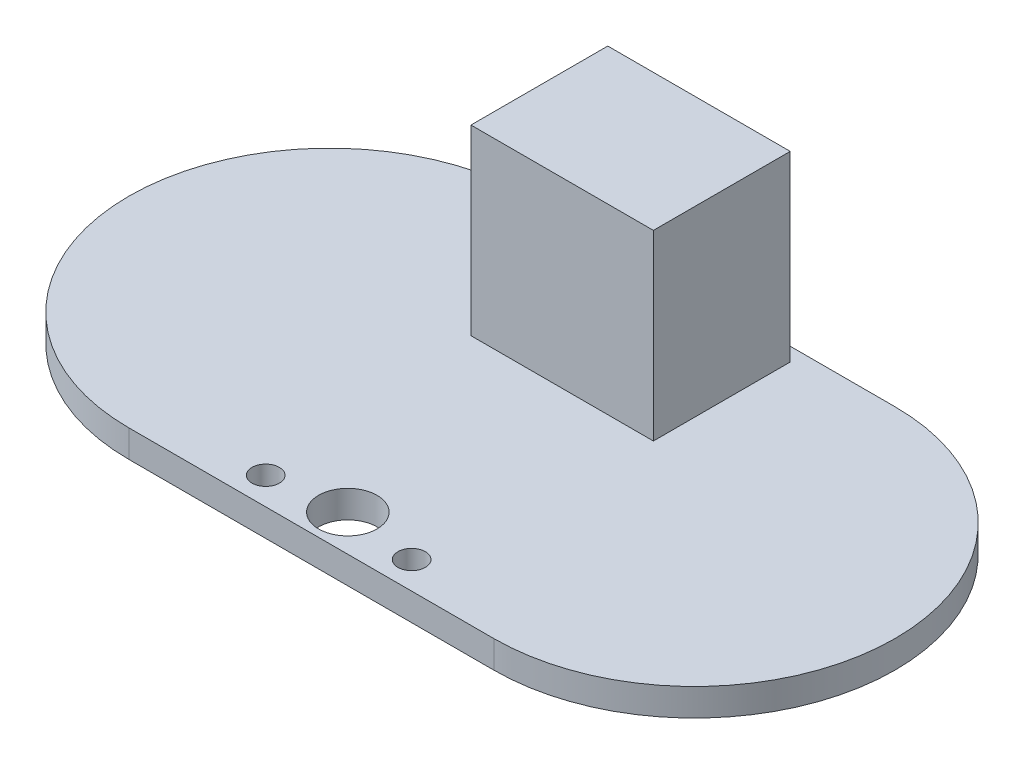
ISO-10303-21;
HEADER;
FILE_DESCRIPTION(('STEP AP214'),'2;1');
FILE_NAME('part.step','',(''),(''),'','','');
FILE_SCHEMA(('AUTOMOTIVE_DESIGN { 1 0 10303 214 1 1 1 1 }'));
ENDSEC;
DATA;
#1=APPLICATION_CONTEXT('core data for automotive mechanical design processes');
#2=APPLICATION_PROTOCOL_DEFINITION('international standard','automotive_design',2000,#1);
#3=PRODUCT_CONTEXT('',#1,'mechanical');
#4=PRODUCT('Part','Part','',(#3));
#5=PRODUCT_RELATED_PRODUCT_CATEGORY('part','',(#4));
#6=PRODUCT_DEFINITION_FORMATION('','',#4);
#7=PRODUCT_DEFINITION_CONTEXT('part definition',#1,'design');
#8=PRODUCT_DEFINITION('design','',#6,#7);
#9=PRODUCT_DEFINITION_SHAPE('','',#8);
#10=(LENGTH_UNIT() NAMED_UNIT(*) SI_UNIT(.MILLI.,.METRE.));
#11=(NAMED_UNIT(*) PLANE_ANGLE_UNIT() SI_UNIT($,.RADIAN.));
#12=(NAMED_UNIT(*) SI_UNIT($,.STERADIAN.) SOLID_ANGLE_UNIT());
#13=UNCERTAINTY_MEASURE_WITH_UNIT(LENGTH_MEASURE(1.E-05),#10,'distance_accuracy_value','');
#14=(GEOMETRIC_REPRESENTATION_CONTEXT(3) GLOBAL_UNCERTAINTY_ASSIGNED_CONTEXT((#13)) GLOBAL_UNIT_ASSIGNED_CONTEXT((#10,
#11,#12)) REPRESENTATION_CONTEXT('',''));
#15=CARTESIAN_POINT('',(0.,0.,0.));
#16=DIRECTION('',(0.,0.,1.));
#17=DIRECTION('',(1.,0.,0.));
#18=AXIS2_PLACEMENT_3D('',#15,#16,#17);
#19=CARTESIAN_POINT('',(0.,1.5,0.));
#20=DIRECTION('',(0.,1.,0.));
#21=DIRECTION('',(0.,0.,1.));
#22=AXIS2_PLACEMENT_3D('',#19,#20,#21);
#23=PLANE('',#22);
#24=CARTESIAN_POINT('',(4.,1.5,9.5));
#25=DIRECTION('',(0.,1.,0.));
#26=DIRECTION('',(0.,0.,1.));
#27=AXIS2_PLACEMENT_3D('',#24,#25,#26);
#28=CIRCLE('',#27,0.750000000000001);
#29=CARTESIAN_POINT('',(4.,1.5,10.25));
#30=VERTEX_POINT('',#29);
#31=EDGE_CURVE('E346',#30,#30,#28,.T.);
#32=ORIENTED_EDGE('',*,*,#31,.F.);
#33=EDGE_LOOP('',(#32));
#34=FACE_BOUND('',#33,.T.);
#35=CARTESIAN_POINT('',(-4.,1.5,9.5));
#36=DIRECTION('',(0.,1.,0.));
#37=DIRECTION('',(0.,0.,1.));
#38=AXIS2_PLACEMENT_3D('',#35,#36,#37);
#39=CIRCLE('',#38,0.75);
#40=CARTESIAN_POINT('',(-4.,1.5,10.25));
#41=VERTEX_POINT('',#40);
#42=EDGE_CURVE('E350',#41,#41,#39,.T.);
#43=ORIENTED_EDGE('',*,*,#42,.F.);
#44=EDGE_LOOP('',(#43));
#45=FACE_BOUND('',#44,.T.);
#46=CARTESIAN_POINT('',(0.,1.5,9.));
#47=DIRECTION('',(0.,1.,0.));
#48=DIRECTION('',(0.,0.,1.));
#49=AXIS2_PLACEMENT_3D('',#46,#47,#48);
#50=CIRCLE('',#49,1.6);
#51=CARTESIAN_POINT('',(0.,1.5,10.6));
#52=VERTEX_POINT('',#51);
#53=EDGE_CURVE('E358',#52,#52,#50,.T.);
#54=ORIENTED_EDGE('',*,*,#53,.F.);
#55=EDGE_LOOP('',(#54));
#56=FACE_BOUND('',#55,.T.);
#57=DIRECTION('',(-1.,0.,0.));
#58=VECTOR('',#57,1.);
#59=CARTESIAN_POINT('',(0.,1.5,11.));
#60=LINE('',#59,#58);
#61=CARTESIAN_POINT('',(10.,1.5,11.));
#62=VERTEX_POINT('',#61);
#63=CARTESIAN_POINT('',(-10.,1.5,11.));
#64=VERTEX_POINT('',#63);
#65=EDGE_CURVE('E138',#62,#64,#60,.T.);
#66=ORIENTED_EDGE('',*,*,#65,.F.);
#67=CARTESIAN_POINT('',(10.,1.5,0.));
#68=DIRECTION('',(0.,1.,0.));
#69=DIRECTION('',(0.,0.,1.));
#70=AXIS2_PLACEMENT_3D('',#67,#68,#69);
#71=CIRCLE('',#70,11.);
#72=CARTESIAN_POINT('',(10.,1.5,-11.));
#73=VERTEX_POINT('',#72);
#74=EDGE_CURVE('E140',#62,#73,#71,.T.);
#75=ORIENTED_EDGE('',*,*,#74,.T.);
#76=DIRECTION('',(-1.,0.,0.));
#77=VECTOR('',#76,1.);
#78=CARTESIAN_POINT('',(0.,1.5,-11.));
#79=LINE('',#78,#77);
#80=CARTESIAN_POINT('',(-10.,1.5,-11.));
#81=VERTEX_POINT('',#80);
#82=EDGE_CURVE('E143',#73,#81,#79,.T.);
#83=ORIENTED_EDGE('',*,*,#82,.T.);
#84=CARTESIAN_POINT('',(-10.,1.5,0.));
#85=DIRECTION('',(0.,1.,0.));
#86=DIRECTION('',(0.,0.,1.));
#87=AXIS2_PLACEMENT_3D('',#84,#85,#86);
#88=CIRCLE('',#87,11.);
#89=EDGE_CURVE('E145',#64,#81,#88,.F.);
#90=ORIENTED_EDGE('',*,*,#89,.F.);
#91=EDGE_LOOP('',(#66,#75,#83,#90));
#92=FACE_BOUND('',#91,.T.);
#93=DIRECTION('',(-1.,0.,0.));
#94=VECTOR('',#93,1.);
#95=CARTESIAN_POINT('',(-5.,1.5,-10.25));
#96=LINE('',#95,#94);
#97=CARTESIAN_POINT('',(5.,1.5,-10.25));
#98=VERTEX_POINT('',#97);
#99=CARTESIAN_POINT('',(-5.,1.5,-10.25));
#100=VERTEX_POINT('',#99);
#101=EDGE_CURVE('E365',#98,#100,#96,.T.);
#102=ORIENTED_EDGE('',*,*,#101,.F.);
#103=DIRECTION('',(0.,0.,-1.));
#104=VECTOR('',#103,1.);
#105=CARTESIAN_POINT('',(5.,1.5,-10.25));
#106=LINE('',#105,#104);
#107=CARTESIAN_POINT('',(5.,1.5,-2.75));
#108=VERTEX_POINT('',#107);
#109=EDGE_CURVE('E129',#108,#98,#106,.T.);
#110=ORIENTED_EDGE('',*,*,#109,.F.);
#111=DIRECTION('',(1.,0.,0.));
#112=VECTOR('',#111,1.);
#113=CARTESIAN_POINT('',(-5.,1.5,-2.75));
#114=LINE('',#113,#112);
#115=CARTESIAN_POINT('',(-5.,1.5,-2.75));
#116=VERTEX_POINT('',#115);
#117=EDGE_CURVE('E125',#116,#108,#114,.T.);
#118=ORIENTED_EDGE('',*,*,#117,.F.);
#119=DIRECTION('',(0.,0.,1.));
#120=VECTOR('',#119,1.);
#121=CARTESIAN_POINT('',(-5.,1.5,-10.25));
#122=LINE('',#121,#120);
#123=EDGE_CURVE('E367',#100,#116,#122,.T.);
#124=ORIENTED_EDGE('',*,*,#123,.F.);
#125=EDGE_LOOP('',(#102,#110,#118,#124));
#126=FACE_BOUND('',#125,.T.);
#127=ADVANCED_FACE('F37',(#34,#45,#56,#92,#126),#23,.T.);
#128=CARTESIAN_POINT('',(0.,1.5,11.));
#129=DIRECTION('',(0.,0.,1.));
#130=DIRECTION('',(1.,0.,0.));
#131=AXIS2_PLACEMENT_3D('',#128,#129,#130);
#132=PLANE('',#131);
#133=DIRECTION('',(-1.,0.,0.));
#134=VECTOR('',#133,1.);
#135=CARTESIAN_POINT('',(0.,0.,11.));
#136=LINE('',#135,#134);
#137=CARTESIAN_POINT('',(10.,0.,11.));
#138=VERTEX_POINT('',#137);
#139=CARTESIAN_POINT('',(-10.,0.,11.));
#140=VERTEX_POINT('',#139);
#141=EDGE_CURVE('E131',#138,#140,#136,.T.);
#142=ORIENTED_EDGE('',*,*,#141,.F.);
#143=DIRECTION('',(0.,-1.,0.));
#144=VECTOR('',#143,1.);
#145=CARTESIAN_POINT('',(10.,1.5,11.));
#146=LINE('',#145,#144);
#147=EDGE_CURVE('E11',#62,#138,#146,.T.);
#148=ORIENTED_EDGE('',*,*,#147,.F.);
#149=ORIENTED_EDGE('',*,*,#65,.T.);
#150=DIRECTION('',(0.,-1.,0.));
#151=VECTOR('',#150,1.);
#152=CARTESIAN_POINT('',(-10.,1.5,11.));
#153=LINE('',#152,#151);
#154=EDGE_CURVE('E61',#64,#140,#153,.T.);
#155=ORIENTED_EDGE('',*,*,#154,.T.);
#156=EDGE_LOOP('',(#142,#148,#149,#155));
#157=FACE_BOUND('',#156,.T.);
#158=ADVANCED_FACE('F39',(#157),#132,.T.);
#159=CARTESIAN_POINT('',(10.,1.5,0.));
#160=DIRECTION('',(0.,-1.,0.));
#161=DIRECTION('',(0.,0.,-1.));
#162=AXIS2_PLACEMENT_3D('',#159,#160,#161);
#163=CYLINDRICAL_SURFACE('',#162,11.);
#164=CARTESIAN_POINT('',(10.,0.,0.));
#165=DIRECTION('',(0.,1.,0.));
#166=DIRECTION('',(0.,0.,1.));
#167=AXIS2_PLACEMENT_3D('',#164,#165,#166);
#168=CIRCLE('',#167,11.);
#169=CARTESIAN_POINT('',(10.,0.,-11.));
#170=VERTEX_POINT('',#169);
#171=EDGE_CURVE('E133',#138,#170,#168,.T.);
#172=ORIENTED_EDGE('',*,*,#171,.T.);
#173=DIRECTION('',(0.,-1.,0.));
#174=VECTOR('',#173,1.);
#175=CARTESIAN_POINT('',(10.,1.5,-11.));
#176=LINE('',#175,#174);
#177=EDGE_CURVE('E45',#73,#170,#176,.T.);
#178=ORIENTED_EDGE('',*,*,#177,.F.);
#179=ORIENTED_EDGE('',*,*,#74,.F.);
#180=ORIENTED_EDGE('',*,*,#147,.T.);
#181=EDGE_LOOP('',(#172,#178,#179,#180));
#182=FACE_BOUND('',#181,.T.);
#183=ADVANCED_FACE('F171',(#182),#163,.T.);
#184=CARTESIAN_POINT('',(0.,1.5,-11.));
#185=DIRECTION('',(0.,0.,1.));
#186=DIRECTION('',(1.,0.,0.));
#187=AXIS2_PLACEMENT_3D('',#184,#185,#186);
#188=PLANE('',#187);
#189=DIRECTION('',(-1.,0.,0.));
#190=VECTOR('',#189,1.);
#191=CARTESIAN_POINT('',(0.,0.,-11.));
#192=LINE('',#191,#190);
#193=CARTESIAN_POINT('',(-10.,0.,-11.));
#194=VERTEX_POINT('',#193);
#195=EDGE_CURVE('E148',#170,#194,#192,.T.);
#196=ORIENTED_EDGE('',*,*,#195,.T.);
#197=DIRECTION('',(0.,-1.,0.));
#198=VECTOR('',#197,1.);
#199=CARTESIAN_POINT('',(-10.,1.5,-11.));
#200=LINE('',#199,#198);
#201=EDGE_CURVE('E154',#81,#194,#200,.T.);
#202=ORIENTED_EDGE('',*,*,#201,.F.);
#203=ORIENTED_EDGE('',*,*,#82,.F.);
#204=ORIENTED_EDGE('',*,*,#177,.T.);
#205=EDGE_LOOP('',(#196,#202,#203,#204));
#206=FACE_BOUND('',#205,.T.);
#207=ADVANCED_FACE('F160',(#206),#188,.F.);
#208=CARTESIAN_POINT('',(-10.,1.5,0.));
#209=DIRECTION('',(0.,-1.,0.));
#210=DIRECTION('',(0.,0.,-1.));
#211=AXIS2_PLACEMENT_3D('',#208,#209,#210);
#212=CYLINDRICAL_SURFACE('',#211,11.);
#213=CARTESIAN_POINT('',(-10.,0.,0.));
#214=DIRECTION('',(0.,1.,0.));
#215=DIRECTION('',(0.,0.,1.));
#216=AXIS2_PLACEMENT_3D('',#213,#214,#215);
#217=CIRCLE('',#216,11.);
#218=EDGE_CURVE('E141',#140,#194,#217,.F.);
#219=ORIENTED_EDGE('',*,*,#218,.F.);
#220=ORIENTED_EDGE('',*,*,#154,.F.);
#221=ORIENTED_EDGE('',*,*,#89,.T.);
#222=ORIENTED_EDGE('',*,*,#201,.T.);
#223=EDGE_LOOP('',(#219,#220,#221,#222));
#224=FACE_BOUND('',#223,.T.);
#225=ADVANCED_FACE('F166',(#224),#212,.T.);
#226=CARTESIAN_POINT('',(0.,0.,0.));
#227=DIRECTION('',(0.,1.,0.));
#228=DIRECTION('',(0.,0.,1.));
#229=AXIS2_PLACEMENT_3D('',#226,#227,#228);
#230=PLANE('',#229);
#231=CARTESIAN_POINT('',(4.,0.,9.5));
#232=DIRECTION('',(0.,1.,0.));
#233=DIRECTION('',(0.,0.,1.));
#234=AXIS2_PLACEMENT_3D('',#231,#232,#233);
#235=CIRCLE('',#234,0.750000000000001);
#236=CARTESIAN_POINT('',(4.,0.,10.25));
#237=VERTEX_POINT('',#236);
#238=EDGE_CURVE('E344',#237,#237,#235,.T.);
#239=ORIENTED_EDGE('',*,*,#238,.T.);
#240=EDGE_LOOP('',(#239));
#241=FACE_BOUND('',#240,.T.);
#242=CARTESIAN_POINT('',(-4.,0.,9.5));
#243=DIRECTION('',(0.,1.,0.));
#244=DIRECTION('',(0.,0.,1.));
#245=AXIS2_PLACEMENT_3D('',#242,#243,#244);
#246=CIRCLE('',#245,0.75);
#247=CARTESIAN_POINT('',(-4.,0.,10.25));
#248=VERTEX_POINT('',#247);
#249=EDGE_CURVE('E347',#248,#248,#246,.T.);
#250=ORIENTED_EDGE('',*,*,#249,.T.);
#251=EDGE_LOOP('',(#250));
#252=FACE_BOUND('',#251,.T.);
#253=CARTESIAN_POINT('',(0.,0.,9.));
#254=DIRECTION('',(0.,1.,0.));
#255=DIRECTION('',(0.,0.,1.));
#256=AXIS2_PLACEMENT_3D('',#253,#254,#255);
#257=CIRCLE('',#256,1.6);
#258=CARTESIAN_POINT('',(0.,0.,10.6));
#259=VERTEX_POINT('',#258);
#260=EDGE_CURVE('E355',#259,#259,#257,.T.);
#261=ORIENTED_EDGE('',*,*,#260,.T.);
#262=EDGE_LOOP('',(#261));
#263=FACE_BOUND('',#262,.T.);
#264=ORIENTED_EDGE('',*,*,#141,.T.);
#265=ORIENTED_EDGE('',*,*,#218,.T.);
#266=ORIENTED_EDGE('',*,*,#195,.F.);
#267=ORIENTED_EDGE('',*,*,#171,.F.);
#268=EDGE_LOOP('',(#264,#265,#266,#267));
#269=FACE_BOUND('',#268,.T.);
#270=ADVANCED_FACE('F165',(#241,#252,#263,#269),#230,.F.);
#271=CARTESIAN_POINT('',(5.,11.5,-10.25));
#272=DIRECTION('',(-1.,0.,0.));
#273=DIRECTION('',(0.,0.,1.));
#274=AXIS2_PLACEMENT_3D('',#271,#272,#273);
#275=PLANE('',#274);
#276=ORIENTED_EDGE('',*,*,#109,.T.);
#277=DIRECTION('',(0.,-1.,0.));
#278=VECTOR('',#277,1.);
#279=CARTESIAN_POINT('',(5.,11.5,-10.25));
#280=LINE('',#279,#278);
#281=CARTESIAN_POINT('',(5.,11.5,-10.25));
#282=VERTEX_POINT('',#281);
#283=EDGE_CURVE('E110',#282,#98,#280,.T.);
#284=ORIENTED_EDGE('',*,*,#283,.F.);
#285=DIRECTION('',(0.,0.,-1.));
#286=VECTOR('',#285,1.);
#287=CARTESIAN_POINT('',(5.,11.5,-10.25));
#288=LINE('',#287,#286);
#289=CARTESIAN_POINT('',(5.,11.5,-2.75));
#290=VERTEX_POINT('',#289);
#291=EDGE_CURVE('E117',#290,#282,#288,.T.);
#292=ORIENTED_EDGE('',*,*,#291,.F.);
#293=DIRECTION('',(0.,-1.,0.));
#294=VECTOR('',#293,1.);
#295=CARTESIAN_POINT('',(5.,11.5,-2.75));
#296=LINE('',#295,#294);
#297=EDGE_CURVE('E363',#290,#108,#296,.T.);
#298=ORIENTED_EDGE('',*,*,#297,.T.);
#299=EDGE_LOOP('',(#276,#284,#292,#298));
#300=FACE_BOUND('',#299,.T.);
#301=ADVANCED_FACE('F127',(#300),#275,.F.);
#302=CARTESIAN_POINT('',(-5.,11.5,-10.25));
#303=DIRECTION('',(0.,0.,1.));
#304=DIRECTION('',(1.,0.,0.));
#305=AXIS2_PLACEMENT_3D('',#302,#303,#304);
#306=PLANE('',#305);
#307=ORIENTED_EDGE('',*,*,#101,.T.);
#308=DIRECTION('',(0.,-1.,0.));
#309=VECTOR('',#308,1.);
#310=CARTESIAN_POINT('',(-5.,11.5,-10.25));
#311=LINE('',#310,#309);
#312=CARTESIAN_POINT('',(-5.,11.5,-10.25));
#313=VERTEX_POINT('',#312);
#314=EDGE_CURVE('E113',#313,#100,#311,.T.);
#315=ORIENTED_EDGE('',*,*,#314,.F.);
#316=DIRECTION('',(-1.,0.,0.));
#317=VECTOR('',#316,1.);
#318=CARTESIAN_POINT('',(-5.,11.5,-10.25));
#319=LINE('',#318,#317);
#320=EDGE_CURVE('E106',#282,#313,#319,.T.);
#321=ORIENTED_EDGE('',*,*,#320,.F.);
#322=ORIENTED_EDGE('',*,*,#283,.T.);
#323=EDGE_LOOP('',(#307,#315,#321,#322));
#324=FACE_BOUND('',#323,.T.);
#325=ADVANCED_FACE('F108',(#324),#306,.F.);
#326=CARTESIAN_POINT('',(-5.,11.5,-10.25));
#327=DIRECTION('',(1.,0.,0.));
#328=DIRECTION('',(0.,0.,-1.));
#329=AXIS2_PLACEMENT_3D('',#326,#327,#328);
#330=PLANE('',#329);
#331=ORIENTED_EDGE('',*,*,#123,.T.);
#332=DIRECTION('',(0.,-1.,0.));
#333=VECTOR('',#332,1.);
#334=CARTESIAN_POINT('',(-5.,11.5,-2.75));
#335=LINE('',#334,#333);
#336=CARTESIAN_POINT('',(-5.,11.5,-2.75));
#337=VERTEX_POINT('',#336);
#338=EDGE_CURVE('E52',#337,#116,#335,.T.);
#339=ORIENTED_EDGE('',*,*,#338,.F.);
#340=DIRECTION('',(0.,0.,1.));
#341=VECTOR('',#340,1.);
#342=CARTESIAN_POINT('',(-5.,11.5,-10.25));
#343=LINE('',#342,#341);
#344=EDGE_CURVE('E116',#313,#337,#343,.T.);
#345=ORIENTED_EDGE('',*,*,#344,.F.);
#346=ORIENTED_EDGE('',*,*,#314,.T.);
#347=EDGE_LOOP('',(#331,#339,#345,#346));
#348=FACE_BOUND('',#347,.T.);
#349=ADVANCED_FACE('F212',(#348),#330,.F.);
#350=CARTESIAN_POINT('',(-5.,11.5,-2.75));
#351=DIRECTION('',(0.,0.,-1.));
#352=DIRECTION('',(-1.,0.,0.));
#353=AXIS2_PLACEMENT_3D('',#350,#351,#352);
#354=PLANE('',#353);
#355=ORIENTED_EDGE('',*,*,#117,.T.);
#356=ORIENTED_EDGE('',*,*,#297,.F.);
#357=DIRECTION('',(1.,0.,0.));
#358=VECTOR('',#357,1.);
#359=CARTESIAN_POINT('',(-5.,11.5,-2.75));
#360=LINE('',#359,#358);
#361=EDGE_CURVE('E121',#337,#290,#360,.T.);
#362=ORIENTED_EDGE('',*,*,#361,.F.);
#363=ORIENTED_EDGE('',*,*,#338,.T.);
#364=EDGE_LOOP('',(#355,#356,#362,#363));
#365=FACE_BOUND('',#364,.T.);
#366=ADVANCED_FACE('F218',(#365),#354,.F.);
#367=CARTESIAN_POINT('',(0.,11.5,0.));
#368=DIRECTION('',(0.,1.,0.));
#369=DIRECTION('',(0.,0.,1.));
#370=AXIS2_PLACEMENT_3D('',#367,#368,#369);
#371=PLANE('',#370);
#372=ORIENTED_EDGE('',*,*,#291,.T.);
#373=ORIENTED_EDGE('',*,*,#320,.T.);
#374=ORIENTED_EDGE('',*,*,#344,.T.);
#375=ORIENTED_EDGE('',*,*,#361,.T.);
#376=EDGE_LOOP('',(#372,#373,#374,#375));
#377=FACE_BOUND('',#376,.T.);
#378=ADVANCED_FACE('F120',(#377),#371,.T.);
#379=CARTESIAN_POINT('',(0.,0.,9.));
#380=DIRECTION('',(0.,1.,0.));
#381=DIRECTION('',(0.,0.,1.));
#382=AXIS2_PLACEMENT_3D('',#379,#380,#381);
#383=CYLINDRICAL_SURFACE('',#382,1.6);
#384=ORIENTED_EDGE('',*,*,#260,.F.);
#385=EDGE_LOOP('',(#384));
#386=FACE_BOUND('',#385,.T.);
#387=ORIENTED_EDGE('',*,*,#53,.T.);
#388=EDGE_LOOP('',(#387));
#389=FACE_BOUND('',#388,.T.);
#390=ADVANCED_FACE('F232',(#386,#389),#383,.F.);
#391=CARTESIAN_POINT('',(-4.,0.,9.5));
#392=DIRECTION('',(0.,1.,0.));
#393=DIRECTION('',(0.,0.,1.));
#394=AXIS2_PLACEMENT_3D('',#391,#392,#393);
#395=CYLINDRICAL_SURFACE('',#394,0.75);
#396=ORIENTED_EDGE('',*,*,#249,.F.);
#397=EDGE_LOOP('',(#396));
#398=FACE_BOUND('',#397,.T.);
#399=ORIENTED_EDGE('',*,*,#42,.T.);
#400=EDGE_LOOP('',(#399));
#401=FACE_BOUND('',#400,.T.);
#402=ADVANCED_FACE('F238',(#398,#401),#395,.F.);
#403=CARTESIAN_POINT('',(4.,0.,9.5));
#404=DIRECTION('',(0.,1.,0.));
#405=DIRECTION('',(0.,0.,1.));
#406=AXIS2_PLACEMENT_3D('',#403,#404,#405);
#407=CYLINDRICAL_SURFACE('',#406,0.750000000000001);
#408=ORIENTED_EDGE('',*,*,#238,.F.);
#409=EDGE_LOOP('',(#408));
#410=FACE_BOUND('',#409,.T.);
#411=ORIENTED_EDGE('',*,*,#31,.T.);
#412=EDGE_LOOP('',(#411));
#413=FACE_BOUND('',#412,.T.);
#414=ADVANCED_FACE('F246',(#410,#413),#407,.F.);
#415=CLOSED_SHELL('',(#127,#158,#183,#207,#225,#270,#301,#325,#349,#366,#378,#390,#402,#414));
#416=MANIFOLD_SOLID_BREP('B2',#415);
#417=ADVANCED_BREP_SHAPE_REPRESENTATION('',(#18,#416),#14);
#418=SHAPE_DEFINITION_REPRESENTATION(#9,#417);
ENDSEC;
END-ISO-10303-21;
